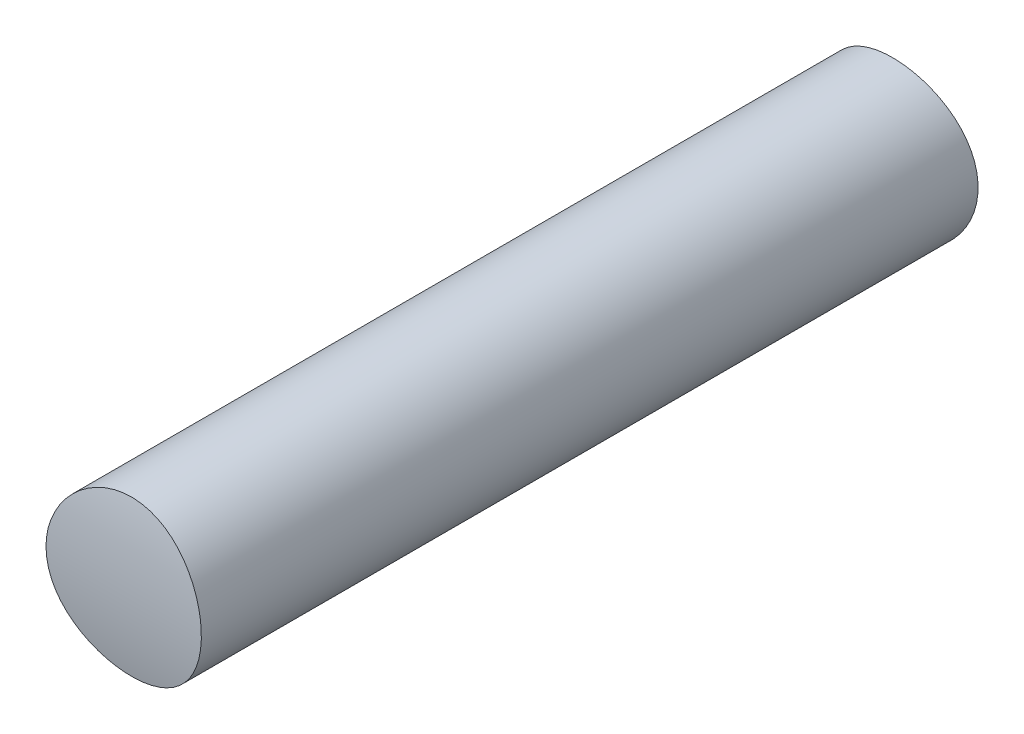
ISO-10303-21;
HEADER;
FILE_DESCRIPTION(('STEP AP214'),'2;1');
FILE_NAME('part.step','',(''),(''),'','','');
FILE_SCHEMA(('AUTOMOTIVE_DESIGN { 1 0 10303 214 1 1 1 1 }'));
ENDSEC;
DATA;
#1=APPLICATION_CONTEXT('core data for automotive mechanical design processes');
#2=APPLICATION_PROTOCOL_DEFINITION('international standard','automotive_design',2000,#1);
#3=PRODUCT_CONTEXT('',#1,'mechanical');
#4=PRODUCT('Part','Part','',(#3));
#5=PRODUCT_RELATED_PRODUCT_CATEGORY('part','',(#4));
#6=PRODUCT_DEFINITION_FORMATION('','',#4);
#7=PRODUCT_DEFINITION_CONTEXT('part definition',#1,'design');
#8=PRODUCT_DEFINITION('design','',#6,#7);
#9=PRODUCT_DEFINITION_SHAPE('','',#8);
#10=(LENGTH_UNIT() NAMED_UNIT(*) SI_UNIT(.MILLI.,.METRE.));
#11=(NAMED_UNIT(*) PLANE_ANGLE_UNIT() SI_UNIT($,.RADIAN.));
#12=(NAMED_UNIT(*) SI_UNIT($,.STERADIAN.) SOLID_ANGLE_UNIT());
#13=UNCERTAINTY_MEASURE_WITH_UNIT(LENGTH_MEASURE(1.E-05),#10,'distance_accuracy_value','');
#14=(GEOMETRIC_REPRESENTATION_CONTEXT(3) GLOBAL_UNCERTAINTY_ASSIGNED_CONTEXT((#13)) GLOBAL_UNIT_ASSIGNED_CONTEXT((#10,
#11,#12)) REPRESENTATION_CONTEXT('',''));
#15=CARTESIAN_POINT('',(0.,0.,0.));
#16=DIRECTION('',(0.,0.,1.));
#17=DIRECTION('',(1.,0.,0.));
#18=AXIS2_PLACEMENT_3D('',#15,#16,#17);
#19=CARTESIAN_POINT('',(0.,0.,37.5));
#20=DIRECTION('',(0.,0.,-1.));
#21=DIRECTION('',(-1.,0.,0.));
#22=AXIS2_PLACEMENT_3D('',#19,#20,#21);
#23=CYLINDRICAL_SURFACE('',#22,7.5);
#24=CARTESIAN_POINT('',(-7.5,0.,-37.5));
#25=CARTESIAN_POINT('',(-7.49999902971956,0.208285250918019,-37.4999995169678));
#26=CARTESIAN_POINT('',(-7.49131612405443,0.416595944699032,-37.4982602523473));
#27=CARTESIAN_POINT('',(-7.45664426063963,0.831795161758265,-37.4913491590143));
#28=CARTESIAN_POINT('',(-7.43064748066552,1.0386829995019,-37.4861757788082));
#29=CARTESIAN_POINT('',(-7.36149503695667,1.44979441328923,-37.4725293883136));
#30=CARTESIAN_POINT('',(-7.31831272239691,1.6540133400208,-37.4640512535298));
#31=CARTESIAN_POINT('',(-7.21511011170672,2.05807781361966,-37.4440282791705));
#32=CARTESIAN_POINT('',(-7.15508340534659,2.2579216642539,-37.4324822721878));
#33=CARTESIAN_POINT('',(-7.0187851239922,2.65140120687642,-37.4066689059164));
#34=CARTESIAN_POINT('',(-6.94254308411286,2.84504745934689,-37.3924064992328));
#35=CARTESIAN_POINT('',(-6.77428825915883,3.2252521960877,-37.3615329427972));
#36=CARTESIAN_POINT('',(-6.68226964591508,3.41180802979487,-37.3449209254522));
#37=CARTESIAN_POINT('',(-6.48322039652258,3.77636781419721,-37.3098185627179));
#38=CARTESIAN_POINT('',(-6.37620063391718,3.95437783493624,-37.2913295804949));
#39=CARTESIAN_POINT('',(-6.14780818386624,4.30087522835744,-37.2529579060111));
#40=CARTESIAN_POINT('',(-6.02643006447892,4.46935896127352,-37.2330746874594));
#41=CARTESIAN_POINT('',(-5.76866577078873,4.79755639657858,-37.192218618291));
#42=CARTESIAN_POINT('',(-5.6321189892616,4.9571427192329,-37.1712356574786));
#43=CARTESIAN_POINT('',(-5.34608468592072,5.26435639175619,-37.1289726594288));
#44=CARTESIAN_POINT('',(-5.19659129850026,5.41197826174014,-37.1076924912389));
#45=CARTESIAN_POINT('',(-4.8857061435719,5.69420372354363,-37.0654341911967));
#46=CARTESIAN_POINT('',(-4.72431279562634,5.828805580663,-37.0444560999071));
#47=CARTESIAN_POINT('',(-4.39080564665395,6.08398652665161,-37.0034026416353));
#48=CARTESIAN_POINT('',(-4.21869672948238,6.2045719330121,-36.9833268704816));
#49=CARTESIAN_POINT('',(-3.86316251866858,6.43202393251202,-36.9444517127192));
#50=CARTESIAN_POINT('',(-3.67964504016922,6.53874889172942,-36.9256663073429));
#51=CARTESIAN_POINT('',(-3.30413988201603,6.7362934120683,-36.8901399392458));
#52=CARTESIAN_POINT('',(-3.11215548629846,6.82711907306035,-36.8733981932111));
#53=CARTESIAN_POINT('',(-2.72094072838064,6.99225097605654,-36.8424414322892));
#54=CARTESIAN_POINT('',(-2.5217081902631,7.06655220895189,-36.8282271838324));
#55=CARTESIAN_POINT('',(-2.11756010982976,7.19799088390685,-36.8027636444553));
#56=CARTESIAN_POINT('',(-1.91264686283292,7.25513515101934,-36.7915131747607));
#57=CARTESIAN_POINT('',(-1.50119692955397,7.35122229614338,-36.7724339900126));
#58=CARTESIAN_POINT('',(-1.2947141202986,7.39038762689044,-36.7645635374252));
#59=CARTESIAN_POINT('',(-0.879165267599078,7.45125138010214,-36.7522763809965));
#60=CARTESIAN_POINT('',(-0.670100218718799,7.47295632686055,-36.7478583871179));
#61=CARTESIAN_POINT('',(-0.250821212441949,7.49874710722053,-36.74260423411));
#62=CARTESIAN_POINT('',(-0.0406071479912055,7.50283127007261,-36.7417684146316));
#63=CARTESIAN_POINT('',(0.379404347814056,7.4933421237438,-36.7437048678115));
#64=CARTESIAN_POINT('',(0.589201782647613,7.47976896263553,-36.746477110213));
#65=CARTESIAN_POINT('',(1.0036463337713,7.43541944129836,-36.7554762999837));
#66=CARTESIAN_POINT('',(1.20832315749137,7.4049092024866,-36.7616497946248));
#67=CARTESIAN_POINT('',(1.61440860579773,7.32710306324073,-36.7772366166266));
#68=CARTESIAN_POINT('',(1.81581607215807,7.27980134423553,-36.7866510670066));
#69=CARTESIAN_POINT('',(2.21382326765599,7.16879743887004,-36.8084438338772));
#70=CARTESIAN_POINT('',(2.41042451393873,7.1051005030216,-36.8208212014152));
#71=CARTESIAN_POINT('',(2.79761460561681,6.96175161590562,-36.8481931225643));
#72=CARTESIAN_POINT('',(2.98820118172495,6.88209372406487,-36.863188650371));
#73=CARTESIAN_POINT('',(3.36320817291061,6.70685770605166,-36.8954745648375));
#74=CARTESIAN_POINT('',(3.54758110214772,6.61118057945138,-36.912779077117));
#75=CARTESIAN_POINT('',(3.90769411401562,6.40491989100834,-36.9491267238105));
#76=CARTESIAN_POINT('',(4.08343118598493,6.29433118024173,-36.9681704580363));
#77=CARTESIAN_POINT('',(4.42502016164686,6.05905927201757,-37.0074589379098));
#78=CARTESIAN_POINT('',(4.5908735312183,5.9343781726258,-37.0277035045657));
#79=CARTESIAN_POINT('',(4.91163849412743,5.67175232845816,-37.0688398344937));
#80=CARTESIAN_POINT('',(5.0665499554376,5.53380742368564,-37.0897316055708));
#81=CARTESIAN_POINT('',(5.36709828642525,5.24297308993082,-37.131970129163));
#82=CARTESIAN_POINT('',(5.51251793361918,5.08985929419431,-37.1533183006386));
#83=CARTESIAN_POINT('',(5.78991839269497,4.77193228210156,-37.195488461239));
#84=CARTESIAN_POINT('',(5.92190373024777,4.60712303760459,-37.2163106257729));
#85=CARTESIAN_POINT('',(6.17167270163691,4.26673796614689,-37.2568697205683));
#86=CARTESIAN_POINT('',(6.28944475511812,4.09115353339292,-37.2766057588753));
#87=CARTESIAN_POINT('',(6.50977653322547,3.73060678119788,-37.3144129068572));
#88=CARTESIAN_POINT('',(6.61234204003817,3.54564806234884,-37.3324846483743));
#89=CARTESIAN_POINT('',(6.80181869301121,3.16704827835546,-37.3665093748376));
#90=CARTESIAN_POINT('',(6.88868601790013,2.97338473733911,-37.3824563970653));
#91=CARTESIAN_POINT('',(7.04572306438673,2.57929421395421,-37.4117128708408));
#92=CARTESIAN_POINT('',(7.11589930759353,2.37886990824627,-37.4250233522079));
#93=CARTESIAN_POINT('',(7.23894265517568,1.97297020126236,-37.4486134500925));
#94=CARTESIAN_POINT('',(7.29183836230164,1.76750375817339,-37.4588980721788));
#95=CARTESIAN_POINT('',(7.38003422880102,1.35277742961405,-37.476166119013));
#96=CARTESIAN_POINT('',(7.41534275783687,1.14351939777807,-37.4831511139574));
#97=CARTESIAN_POINT('',(7.46112304973197,0.778434766567267,-37.4922393572955));
#98=CARTESIAN_POINT('',(7.47569545520945,0.623129384709211,-37.4951454468941));
#99=CARTESIAN_POINT('',(7.49513430028926,0.311887423629806,-37.4990259504125));
#100=CARTESIAN_POINT('',(7.50000072648473,0.155950843536883,-37.500000361664));
#101=CARTESIAN_POINT('',(7.49999902971958,-0.208285250918016,-37.4999995169678));
#102=CARTESIAN_POINT('',(7.49131612405443,-0.416595944699027,-37.4982602523473));
#103=CARTESIAN_POINT('',(7.45664426063963,-0.83179516175826,-37.4913491590143));
#104=CARTESIAN_POINT('',(7.43064748066552,-1.03868299950189,-37.4861757788082));
#105=CARTESIAN_POINT('',(7.36149503695667,-1.44979441328922,-37.4725293883136));
#106=CARTESIAN_POINT('',(7.31831272239692,-1.6540133400208,-37.4640512535298));
#107=CARTESIAN_POINT('',(7.21511011170672,-2.05807781361966,-37.4440282791705));
#108=CARTESIAN_POINT('',(7.15508340534659,-2.2579216642539,-37.4324822721878));
#109=CARTESIAN_POINT('',(7.0187851239922,-2.65140120687642,-37.4066689059164));
#110=CARTESIAN_POINT('',(6.94254308411286,-2.84504745934689,-37.3924064992328));
#111=CARTESIAN_POINT('',(6.77428825915883,-3.2252521960877,-37.3615329427972));
#112=CARTESIAN_POINT('',(6.68226964591508,-3.41180802979488,-37.3449209254522));
#113=CARTESIAN_POINT('',(6.48322039652258,-3.77636781419721,-37.3098185627179));
#114=CARTESIAN_POINT('',(6.37620063391718,-3.95437783493624,-37.2913295804949));
#115=CARTESIAN_POINT('',(6.14780818386623,-4.30087522835744,-37.2529579060111));
#116=CARTESIAN_POINT('',(6.02643006447892,-4.46935896127353,-37.2330746874594));
#117=CARTESIAN_POINT('',(5.76866577078873,-4.79755639657858,-37.192218618291));
#118=CARTESIAN_POINT('',(5.6321189892616,-4.9571427192329,-37.1712356574786));
#119=CARTESIAN_POINT('',(5.34608468592072,-5.26435639175619,-37.1289726594288));
#120=CARTESIAN_POINT('',(5.19659129850026,-5.41197826174014,-37.1076924912389));
#121=CARTESIAN_POINT('',(4.8857061435719,-5.69420372354363,-37.0654341911967));
#122=CARTESIAN_POINT('',(4.72431279562634,-5.82880558066301,-37.0444560999071));
#123=CARTESIAN_POINT('',(4.39080564665395,-6.08398652665161,-37.0034026416353));
#124=CARTESIAN_POINT('',(4.21869672948238,-6.2045719330121,-36.9833268704816));
#125=CARTESIAN_POINT('',(3.86316251866858,-6.43202393251202,-36.9444517127192));
#126=CARTESIAN_POINT('',(3.67964504016922,-6.53874889172942,-36.9256663073429));
#127=CARTESIAN_POINT('',(3.30413988201603,-6.7362934120683,-36.8901399392458));
#128=CARTESIAN_POINT('',(3.11215548629846,-6.82711907306035,-36.8733981932111));
#129=CARTESIAN_POINT('',(2.72094072838064,-6.99225097605654,-36.8424414322892));
#130=CARTESIAN_POINT('',(2.5217081902631,-7.06655220895189,-36.8282271838324));
#131=CARTESIAN_POINT('',(2.11756010982976,-7.19799088390685,-36.8027636444553));
#132=CARTESIAN_POINT('',(1.91264686283292,-7.25513515101934,-36.7915131747607));
#133=CARTESIAN_POINT('',(1.50119692955397,-7.35122229614337,-36.7724339900126));
#134=CARTESIAN_POINT('',(1.2947141202986,-7.39038762689044,-36.7645635374252));
#135=CARTESIAN_POINT('',(0.87916526759908,-7.45125138010214,-36.7522763809965));
#136=CARTESIAN_POINT('',(0.6701002187188,-7.47295632686055,-36.7478583871179));
#137=CARTESIAN_POINT('',(0.250821212441949,-7.49874710722053,-36.74260423411));
#138=CARTESIAN_POINT('',(0.0406071479912055,-7.50283127007261,-36.7417684146316));
#139=CARTESIAN_POINT('',(-0.379404347814056,-7.4933421237438,-36.7437048678115));
#140=CARTESIAN_POINT('',(-0.589201782647614,-7.47976896263553,-36.746477110213));
#141=CARTESIAN_POINT('',(-1.0036463337713,-7.43541944129836,-36.7554762999837));
#142=CARTESIAN_POINT('',(-1.20832315749137,-7.4049092024866,-36.7616497946248));
#143=CARTESIAN_POINT('',(-1.61440860579773,-7.32710306324073,-36.7772366166266));
#144=CARTESIAN_POINT('',(-1.81581607215807,-7.27980134423553,-36.7866510670066));
#145=CARTESIAN_POINT('',(-2.21382326765599,-7.16879743887004,-36.8084438338772));
#146=CARTESIAN_POINT('',(-2.41042451393873,-7.1051005030216,-36.8208212014152));
#147=CARTESIAN_POINT('',(-2.79761460561681,-6.96175161590562,-36.8481931225643));
#148=CARTESIAN_POINT('',(-2.98820118172495,-6.88209372406487,-36.863188650371));
#149=CARTESIAN_POINT('',(-3.36320817291061,-6.70685770605166,-36.8954745648375));
#150=CARTESIAN_POINT('',(-3.54758110214772,-6.61118057945138,-36.912779077117));
#151=CARTESIAN_POINT('',(-3.90769411401562,-6.40491989100834,-36.9491267238105));
#152=CARTESIAN_POINT('',(-4.08343118598492,-6.29433118024173,-36.9681704580363));
#153=CARTESIAN_POINT('',(-4.42502016164686,-6.05905927201757,-37.0074589379098));
#154=CARTESIAN_POINT('',(-4.5908735312183,-5.9343781726258,-37.0277035045657));
#155=CARTESIAN_POINT('',(-4.91163849412743,-5.67175232845816,-37.0688398344937));
#156=CARTESIAN_POINT('',(-5.0665499554376,-5.53380742368564,-37.0897316055708));
#157=CARTESIAN_POINT('',(-5.36709828642525,-5.24297308993082,-37.131970129163));
#158=CARTESIAN_POINT('',(-5.51251793361918,-5.08985929419431,-37.1533183006386));
#159=CARTESIAN_POINT('',(-5.78991839269497,-4.77193228210156,-37.195488461239));
#160=CARTESIAN_POINT('',(-5.92190373024777,-4.60712303760459,-37.2163106257729));
#161=CARTESIAN_POINT('',(-6.17167270163691,-4.26673796614689,-37.2568697205683));
#162=CARTESIAN_POINT('',(-6.28944475511812,-4.09115353339291,-37.2766057588753));
#163=CARTESIAN_POINT('',(-6.50977653322548,-3.73060678119788,-37.3144129068572));
#164=CARTESIAN_POINT('',(-6.61234204003817,-3.54564806234884,-37.3324846483743));
#165=CARTESIAN_POINT('',(-6.80181869301121,-3.16704827835546,-37.3665093748376));
#166=CARTESIAN_POINT('',(-6.88868601790013,-2.97338473733911,-37.3824563970653));
#167=CARTESIAN_POINT('',(-7.04572306438673,-2.57929421395421,-37.4117128708408));
#168=CARTESIAN_POINT('',(-7.11589930759353,-2.37886990824627,-37.4250233522079));
#169=CARTESIAN_POINT('',(-7.23894265517568,-1.97297020126237,-37.4486134500925));
#170=CARTESIAN_POINT('',(-7.29183836230164,-1.76750375817339,-37.4588980721788));
#171=CARTESIAN_POINT('',(-7.38003422880102,-1.35277742961405,-37.476166119013));
#172=CARTESIAN_POINT('',(-7.41534275783686,-1.14351939777807,-37.4831511139574));
#173=CARTESIAN_POINT('',(-7.46112304973197,-0.778434766567266,-37.4922393572955));
#174=CARTESIAN_POINT('',(-7.47569545520946,-0.623129384709209,-37.4951454468941));
#175=CARTESIAN_POINT('',(-7.49513430028926,-0.311887423629804,-37.4990259504125));
#176=CARTESIAN_POINT('',(-7.50000072648472,-0.155950843536881,-37.500000361664));
#177=CARTESIAN_POINT('',(-7.5,0.,-37.5));
#178=B_SPLINE_CURVE_WITH_KNOTS('',3,(#24,#25,#26,#27,#28,#29,#30,#31,#32,#33,#34,#35,#36,#37,
#38,#39,#40,#41,#42,#43,#44,#45,#46,#47,#48,#49,#50,#51,#52,#53,#54,#55,#56,#57,#58,#59,#60,#61,
#62,#63,#64,#65,#66,#67,#68,#69,#70,#71,#72,#73,#74,#75,#76,#77,#78,#79,#80,#81,#82,#83,#84,#85,
#86,#87,#88,#89,#90,#91,#92,#93,#94,#95,#96,#97,#98,#99,#100,#101,#102,#103,#104,#105,#106,#107,
#108,#109,#110,#111,#112,#113,#114,#115,#116,#117,#118,#119,#120,#121,#122,#123,#124,#125,#126,
#127,#128,#129,#130,#131,#132,#133,#134,#135,#136,#137,#138,#139,#140,#141,#142,#143,#144,#145,
#146,#147,#148,#149,#150,#151,#152,#153,#154,#155,#156,#157,#158,#159,#160,#161,#162,#163,#164,
#165,#166,#167,#168,#169,#170,#171,#172,#173,#174,#175,#176,#177),.UNSPECIFIED.,.T.,.F.,(4,2,2,
2,2,2,2,2,2,2,2,2,2,2,2,2,2,2,2,2,2,2,2,2,2,2,2,2,2,2,2,2,2,2,2,2,2,2,2,2,2,2,2,2,2,2,2,2,2,2,2,
2,2,2,2,2,2,2,2,2,2,2,2,2,2,2,2,2,2,2,2,2,2,2,2,2,4),(0.,0.624712197528687,1.24970682502355,
1.8756744764054,2.50188066717014,3.12695588782765,3.75226252278795,4.37711822744394,
5.00221108322053,5.63470129433434,6.26747957662201,6.90034205030294,7.53291816513303,
8.17152043794301,8.80987716724068,9.44842714092995,10.0867227614111,10.7168925185891,
11.3468266953313,11.9768205992162,12.606809220067,13.227168486148,13.8477429288317,
14.4681188814138,15.0887261645959,15.7133209016402,16.3381318642615,16.9628499276509,
17.587575527741,18.2235499120322,18.8593093389876,19.4955833067907,20.1316147117834,
20.7693950512931,21.4069257837235,22.0433958646003,22.6795627620186,23.1473071614475,
23.6150522069703,24.239764404499,24.8647590319938,25.4907266833757,26.1169328741404,
26.7420080947979,27.3673147297582,27.9921704344142,28.6172632901908,29.2497535013046,
29.8825317835923,30.5153942572732,31.1479703721033,31.7865726449133,32.424929374211,
33.0634793479002,33.7017749683814,34.3319447255593,34.9618789023016,35.5918728061865,
36.2218614270373,36.8422206931183,37.462795135802,38.0831710883841,38.7037783715662,
39.3283731086104,39.9531840712318,40.5779021346212,41.2026277347112,41.8386021190025,
42.4743615459578,43.1106355137609,43.7466669187537,44.3844472582634,45.0219779906937,
45.6584480715706,46.2946149689889,46.7623593684178,47.2301044139406),.UNSPECIFIED.);
#179=CARTESIAN_POINT('',(-7.5,0.,-37.5));
#180=VERTEX_POINT('',#179);
#181=EDGE_CURVE('E43',#180,#180,#178,.T.);
#182=ORIENTED_EDGE('',*,*,#181,.F.);
#183=EDGE_LOOP('',(#182));
#184=FACE_BOUND('',#183,.T.);
#185=CARTESIAN_POINT('',(-7.5,0.,37.5));
#186=CARTESIAN_POINT('',(-7.50000415406846,-0.208483315310918,37.5000021097477));
#187=CARTESIAN_POINT('',(-7.49130470044979,-0.41691460283817,37.4982583792321));
#188=CARTESIAN_POINT('',(-7.4565840093247,-0.832334416575861,37.4913367448348));
#189=CARTESIAN_POINT('',(-7.43055984843312,-1.03932269333409,37.4861582613707));
#190=CARTESIAN_POINT('',(-7.36137215586304,-1.45040572618121,37.4725053637865));
#191=CARTESIAN_POINT('',(-7.31819976645866,-1.65449893033555,37.4640292463569));
#192=CARTESIAN_POINT('',(-7.21503802103792,-2.05831663415844,37.4440143844082));
#193=CARTESIAN_POINT('',(-7.15504248405728,-2.25803949899806,37.4324745143239));
#194=CARTESIAN_POINT('',(-7.01879438710297,-2.65137476573173,37.4066706680657));
#195=CARTESIAN_POINT('',(-6.94256376440252,-2.84499501234896,37.3924103704889));
#196=CARTESIAN_POINT('',(-6.77433604938429,-3.22514992041127,37.3615416354369));
#197=CARTESIAN_POINT('',(-6.68233313914487,-3.41168193609257,37.3449323318815));
#198=CARTESIAN_POINT('',(-6.48329211776848,-3.77624624960627,37.3098310017852));
#199=CARTESIAN_POINT('',(-6.37626078318279,-3.95428233017419,37.2913398248392));
#200=CARTESIAN_POINT('',(-6.1478411800004,-4.30082942089902,37.2529633108609));
#201=CARTESIAN_POINT('',(-6.0264474766386,-4.46933678948473,37.2330774472415));
#202=CARTESIAN_POINT('',(-5.7686623125843,-4.7975608015667,37.1922180702349));
#203=CARTESIAN_POINT('',(-5.63211170999935,-4.95715122717416,37.1712345389031));
#204=CARTESIAN_POINT('',(-5.34606910527543,-5.26437243600153,37.1289704003494));
#205=CARTESIAN_POINT('',(-5.1965712379913,-5.41199773974933,37.107689662192));
#206=CARTESIAN_POINT('',(-4.88568482306476,-5.69422181145278,37.0654313950635));
#207=CARTESIAN_POINT('',(-4.72429532675039,-5.82881953812857,37.0444538904434));
#208=CARTESIAN_POINT('',(-4.39079648375255,-6.08399294654521,37.003401572794));
#209=CARTESIAN_POINT('',(-4.21869202069831,-6.20457494551161,36.9833263556041));
#210=CARTESIAN_POINT('',(-3.86316327859793,-6.43202344628043,36.9444517958174));
#211=CARTESIAN_POINT('',(-3.67964660010331,-6.53874798452959,36.9256664669901));
#212=CARTESIAN_POINT('',(-3.30414310550971,-6.73629180278303,36.8901402321636));
#213=CARTESIAN_POINT('',(-3.11215957311373,-6.82711718222068,36.8733985429072));
#214=CARTESIAN_POINT('',(-2.72094493411017,-6.99224936665368,36.8424417389775));
#215=CARTESIAN_POINT('',(-2.52171159076531,-7.06655102254029,36.8282274121546));
#216=CARTESIAN_POINT('',(-2.11756184589631,-7.19799039974723,36.8027637397732));
#217=CARTESIAN_POINT('',(-1.91264773972819,-7.25513494622282,36.7915132154231));
#218=CARTESIAN_POINT('',(-1.50119677217586,-7.35122233290873,36.7724339827146));
#219=CARTESIAN_POINT('',(-1.29471380265331,-7.39038768714153,36.7645635253232));
#220=CARTESIAN_POINT('',(-0.879164627113547,-7.45125146019002,36.7522763647667));
#221=CARTESIAN_POINT('',(-0.670099415671663,-7.47295640337694,36.747858371549));
#222=CARTESIAN_POINT('',(-0.250820406690045,-7.49874712966212,36.7426042295188));
#223=CARTESIAN_POINT('',(-0.040606503827776,-7.50283126903194,36.7417684148642));
#224=CARTESIAN_POINT('',(0.379404668906108,-7.49334210297715,36.7437048720291));
#225=CARTESIAN_POINT('',(0.589201942255277,-7.47976894556144,36.7464771136048));
#226=CARTESIAN_POINT('',(1.00364711210596,-7.43541935800376,36.7554763169571));
#227=CARTESIAN_POINT('',(1.20832470734035,-7.40490897147401,36.7616498416296));
#228=CARTESIAN_POINT('',(1.61441167976592,-7.32710240830468,36.7772367471033));
#229=CARTESIAN_POINT('',(1.81581989853831,-7.27980041213413,36.7866512511086));
#230=CARTESIAN_POINT('',(2.2138269122664,-7.16879628734338,36.808444057063));
#231=CARTESIAN_POINT('',(2.41042726338708,-7.10509954425792,36.8208213856562));
#232=CARTESIAN_POINT('',(2.79761584046053,-6.96175109954607,36.8481932199925));
#233=CARTESIAN_POINT('',(2.98820179013212,-6.88209343903769,36.8631887029329));
#234=CARTESIAN_POINT('',(3.36319921077539,-6.70686189467481,36.8954737930672));
#235=CARTESIAN_POINT('',(3.54756352736487,-6.61118970163632,36.9127774272521));
#236=CARTESIAN_POINT('',(3.90766409763828,-6.40493802768173,36.9491235700507));
#237=CARTESIAN_POINT('',(4.0833971533219,-6.29435307738543,36.9681667158144));
#238=CARTESIAN_POINT('',(4.42495856685814,-6.05910323823583,37.007451680742));
#239=CARTESIAN_POINT('',(4.59078954975946,-5.93444210655371,37.0276931793623));
#240=CARTESIAN_POINT('',(4.91157109943957,-5.67181233229327,37.0688307465389));
#241=CARTESIAN_POINT('',(5.06651758308154,-5.53383874135229,37.0897270565307));
#242=CARTESIAN_POINT('',(5.36707826434377,-5.24299247341352,37.1319673147738));
#243=CARTESIAN_POINT('',(5.51247947298022,-5.08989980615945,37.1533126540753));
#244=CARTESIAN_POINT('',(5.78994262793909,-4.77190807366215,37.1954919452116));
#245=CARTESIAN_POINT('',(5.92199985587514,-4.60700486722731,37.2163257141993));
#246=CARTESIAN_POINT('',(6.17177665724625,-4.26658345159894,37.2568871237155));
#247=CARTESIAN_POINT('',(6.28949833892692,-4.09106680895753,37.2766149266612));
#248=CARTESIAN_POINT('',(6.50978227866336,-3.73059642031793,37.3144139195139));
#249=CARTESIAN_POINT('',(6.61234470988114,-3.54564278214968,37.332485128343));
#250=CARTESIAN_POINT('',(6.80172211840374,-3.16724119278212,37.3664920321893));
#251=CARTESIAN_POINT('',(6.88850910684399,-2.97377888610105,37.3824239187797));
#252=CARTESIAN_POINT('',(7.04542346872728,-2.58009570605891,37.4116565757603));
#253=CARTESIAN_POINT('',(7.11555662288271,-2.37987720548218,37.4249582588515));
#254=CARTESIAN_POINT('',(7.23865573273428,-1.9740391522938,37.4485578358328));
#255=CARTESIAN_POINT('',(7.29162038260822,-1.76841919013666,37.458855501234));
#256=CARTESIAN_POINT('',(7.37994707683015,-1.35329640920947,37.4761489474015));
#257=CARTESIAN_POINT('',(7.41530937121296,-1.143793645637,37.4831447750692));
#258=CARTESIAN_POINT('',(7.46769432554848,-0.726022872298725,37.4935435942351));
#259=CARTESIAN_POINT('',(7.48501703979332,-0.517793904389697,37.4970053485391));
#260=CARTESIAN_POINT('',(7.50223405346,-0.100514006223324,37.5004459103632));
#261=CARTESIAN_POINT('',(7.50212229346546,0.108537184557892,37.5004235069515));
#262=CARTESIAN_POINT('',(7.48445807855669,0.525819777437648,37.4968937200496));
#263=CARTESIAN_POINT('',(7.46690988949873,0.734051367543202,37.493387188958));
#264=CARTESIAN_POINT('',(7.41451997179765,1.14824650562539,37.4829887885253));
#265=CARTESIAN_POINT('',(7.37967783857597,1.35421000042644,37.4760968399849));
#266=CARTESIAN_POINT('',(7.29336932485347,1.76054367551311,37.4591973333901));
#267=CARTESIAN_POINT('',(7.24205586241375,1.96094756464056,37.4492184637627));
#268=CARTESIAN_POINT('',(7.12311271317182,2.35668278023705,37.4263988505881));
#269=CARTESIAN_POINT('',(7.05548315559324,2.55201414686695,37.4135581297068));
#270=CARTESIAN_POINT('',(6.90440792878432,2.93628621963515,37.3853627122177));
#271=CARTESIAN_POINT('',(6.82096124398325,3.12522651450326,37.3700078541931));
#272=CARTESIAN_POINT('',(6.63886096332044,3.49543705856643,37.3371993875037));
#273=CARTESIAN_POINT('',(6.54020741795749,3.67670733322947,37.3197457858083));
#274=CARTESIAN_POINT('',(6.32706970789877,4.03258484683883,37.2829808336499));
#275=CARTESIAN_POINT('',(6.21240405193511,4.20708129122912,37.2636490923871));
#276=CARTESIAN_POINT('',(5.96904288951177,4.54576684050287,37.2238508628629));
#277=CARTESIAN_POINT('',(5.8403522674888,4.70995950266232,37.2033847708714));
#278=CARTESIAN_POINT('',(5.56972552811313,5.02708957326882,37.1618616507606));
#279=CARTESIAN_POINT('',(5.42778342171903,5.1800218361536,37.1408043584827));
#280=CARTESIAN_POINT('',(5.13170963552587,5.47348023494801,37.0986924987934));
#281=CARTESIAN_POINT('',(4.97758232661547,5.61401078147505,37.0776379330941));
#282=CARTESIAN_POINT('',(4.65561631740762,5.88388008800991,37.0357786000378));
#283=CARTESIAN_POINT('',(4.48760097057214,6.0130096061901,37.0149828796051));
#284=CARTESIAN_POINT('',(4.14121601563338,6.2566080498131,36.9745872135942));
#285=CARTESIAN_POINT('',(3.96285024288188,6.37108235596721,36.9549868305356));
#286=CARTESIAN_POINT('',(3.59686678965576,6.58463755429622,36.9175339181867));
#287=CARTESIAN_POINT('',(3.40924584326965,6.68371296066232,36.8996820126197));
#288=CARTESIAN_POINT('',(3.02619151962431,6.86564665357399,36.8662644264114));
#289=CARTESIAN_POINT('',(2.83076123028599,6.94851127514729,36.8506978532788));
#290=CARTESIAN_POINT('',(2.43437144559592,7.09707091203924,36.822374711348));
#291=CARTESIAN_POINT('',(2.23344350624725,7.16284756433133,36.8096048292481));
#292=CARTESIAN_POINT('',(1.82666509150451,7.27721885454303,36.7871646774489));
#293=CARTESIAN_POINT('',(1.62081648291062,7.32581990145493,36.777493251702));
#294=CARTESIAN_POINT('',(1.20560630510901,7.40548466479412,36.7615349291007));
#295=CARTESIAN_POINT('',(0.996244469122745,7.43654704315243,36.7552482904819));
#296=CARTESIAN_POINT('',(0.575569560083804,7.48087232675321,36.7462523700107));
#297=CARTESIAN_POINT('',(0.364256514751329,7.49413548447293,36.7435430374152));
#298=CARTESIAN_POINT('',(-0.0548676279124329,7.50267395939909,36.7418004440825));
#299=CARTESIAN_POINT('',(-0.262671892806006,7.49827463763881,36.7427006907782));
#300=CARTESIAN_POINT('',(-0.677227020143757,7.47224940255876,36.7480021903901));
#301=CARTESIAN_POINT('',(-0.883977491485999,7.45061750423539,36.7524046596538));
#302=CARTESIAN_POINT('',(-1.2947943254336,7.39030407682712,36.764580089633));
#303=CARTESIAN_POINT('',(-1.4988616708182,7.35162898025212,36.7723517787065));
#304=CARTESIAN_POINT('',(-1.90302537971458,7.25751762390039,36.7910415327967));
#305=CARTESIAN_POINT('',(-2.10312024176781,7.20207515050235,36.8019607641531));
#306=CARTESIAN_POINT('',(-2.49734556104152,7.07502941214461,36.8265954172696));
#307=CARTESIAN_POINT('',(-2.69149039723702,7.00346929039375,36.8403033649738));
#308=CARTESIAN_POINT('',(-3.07305484128186,6.84463592993069,36.8701435324314));
#309=CARTESIAN_POINT('',(-3.26047421559238,6.75736214620025,36.8862758362687));
#310=CARTESIAN_POINT('',(-3.62733863002169,6.56772825515018,36.920512239071));
#311=CARTESIAN_POINT('',(-3.80678332182147,6.46536748970107,36.938616424045));
#312=CARTESIAN_POINT('',(-4.15651311230678,6.24627716794432,36.9762947245103));
#313=CARTESIAN_POINT('',(-4.3267980819474,6.12954740927814,36.9958688607013));
#314=CARTESIAN_POINT('',(-4.65991154810879,5.88040938896427,37.036292677648));
#315=CARTESIAN_POINT('',(-4.82256395862688,5.74776822725967,37.0571583909656));
#316=CARTESIAN_POINT('',(-5.13615606408507,5.46935687274789,37.0992715695963));
#317=CARTESIAN_POINT('',(-5.28709589118108,5.32358682811718,37.1205190305987));
#318=CARTESIAN_POINT('',(-5.57631086106478,5.01983590048018,37.1628142700838));
#319=CARTESIAN_POINT('',(-5.7145806404544,4.86184989799891,37.1838619606524));
#320=CARTESIAN_POINT('',(-5.97739026120306,4.53484188370158,37.2251575434954));
#321=CARTESIAN_POINT('',(-6.10193512055828,4.36582394152433,37.2454057263305));
#322=CARTESIAN_POINT('',(-6.33776091387043,4.01594005631662,37.2847629016773));
#323=CARTESIAN_POINT('',(-6.44888297278341,3.83496530621429,37.3038571206718));
#324=CARTESIAN_POINT('',(-6.65541661072577,3.46416700040671,37.3401156271458));
#325=CARTESIAN_POINT('',(-6.75083397632297,3.27434673715674,37.3572806247256));
#326=CARTESIAN_POINT('',(-6.92523675529546,2.88723498954161,37.389190267871));
#327=CARTESIAN_POINT('',(-7.00423210546083,2.68994810908542,37.4039363759352));
#328=CARTESIAN_POINT('',(-7.14523152105939,2.28927663717611,37.4305965678313));
#329=CARTESIAN_POINT('',(-7.20723885993585,2.08589322886263,37.442511197206));
#330=CARTESIAN_POINT('',(-7.33983469078939,1.57380323523498,37.46821309223));
#331=CARTESIAN_POINT('',(-7.39981471601755,1.26218624106522,37.4800712854718));
#332=CARTESIAN_POINT('',(-7.47989357918396,0.633672680464612,37.4959630118578));
#333=CARTESIAN_POINT('',(-7.49999368817422,0.316776282623468,37.4999967943813));
#334=CARTESIAN_POINT('',(-7.5,0.,37.5));
#335=B_SPLINE_CURVE_WITH_KNOTS('',3,(#185,#186,#187,#188,#189,#190,#191,#192,#193,#194,#195,
#196,#197,#198,#199,#200,#201,#202,#203,#204,#205,#206,#207,#208,#209,#210,#211,#212,#213,#214,
#215,#216,#217,#218,#219,#220,#221,#222,#223,#224,#225,#226,#227,#228,#229,#230,#231,#232,#233,
#234,#235,#236,#237,#238,#239,#240,#241,#242,#243,#244,#245,#246,#247,#248,#249,#250,#251,#252,
#253,#254,#255,#256,#257,#258,#259,#260,#261,#262,#263,#264,#265,#266,#267,#268,#269,#270,#271,
#272,#273,#274,#275,#276,#277,#278,#279,#280,#281,#282,#283,#284,#285,#286,#287,#288,#289,#290,
#291,#292,#293,#294,#295,#296,#297,#298,#299,#300,#301,#302,#303,#304,#305,#306,#307,#308,#309,
#310,#311,#312,#313,#314,#315,#316,#317,#318,#319,#320,#321,#322,#323,#324,#325,#326,#327,#328,
#329,#330,#331,#332,#333,#334),.UNSPECIFIED.,.T.,.F.,(4,2,2,2,2,2,2,2,2,2,2,2,2,2,2,2,2,2,2,2,2,
2,2,2,2,2,2,2,2,2,2,2,2,2,2,2,2,2,2,2,2,2,2,2,2,2,2,2,2,2,2,2,2,2,2,2,2,2,2,2,2,2,2,2,2,2,2,2,2,
2,2,2,2,2,4),(0.,0.625171788236199,1.25044909521505,1.87604980309508,2.50188066372338,
3.12687119053535,3.75209275553386,4.3770332983578,5.00221108155898,5.63471814112609,
6.2675132419863,6.90035887976465,7.53291816354519,8.17151772410143,8.80987175766558,
9.44842443669745,10.0867227597562,10.7168930013115,11.3468276598176,11.9768210794987,
12.6068092184148,13.2271708322685,13.84774765741,14.4681208879416,15.0887261629095,
15.7132911534557,16.3380858346729,16.9627141400789,17.58757552662,18.2234659200914,
18.8595803811642,19.4956011793063,20.1316147117104,20.7687458767553,21.4056555628661,
22.0426136804386,22.6795627500027,23.3057394185827,23.9321337176781,24.5583748059139,
25.1846305452698,25.8052326454105,26.4258298305379,27.0464668758717,27.6671018602448,
28.2954494412825,28.9235788845368,29.5519935995908,30.1801839132975,30.8181921574725,
31.4559654788076,32.093965486638,32.7317156696007,33.3663605438108,34.000768352752,
34.635224555717,35.2696717589928,35.8924859130345,36.5155164694753,37.1383120804368,
37.7613387691546,38.3827171721884,39.0041171314846,39.6255442057296,40.2469800325345,
40.8789855974446,41.5109840302459,42.1432487721929,42.7752815781831,43.414183802787,
44.05285008723,44.6911287892514,45.3292844138289,46.2792208967571,47.2291271028397),.UNSPECIFIED.);
#336=CARTESIAN_POINT('',(-7.5,0.,37.5));
#337=VERTEX_POINT('',#336);
#338=EDGE_CURVE('E11',#337,#337,#335,.T.);
#339=ORIENTED_EDGE('',*,*,#338,.F.);
#340=EDGE_LOOP('',(#339));
#341=FACE_BOUND('',#340,.T.);
#342=ADVANCED_FACE('F33',(#184,#341),#23,.T.);
#343=CARTESIAN_POINT('',(-7.5,0.,0.));
#344=DIRECTION('',(1.,0.,0.));
#345=DIRECTION('',(0.,0.,-1.));
#346=AXIS2_PLACEMENT_3D('',#343,#344,#345);
#347=CYLINDRICAL_SURFACE('',#346,37.5);
#348=ORIENTED_EDGE('',*,*,#181,.T.);
#349=EDGE_LOOP('',(#348));
#350=FACE_BOUND('',#349,.T.);
#351=ADVANCED_FACE('F55',(#350),#347,.T.);
#352=ORIENTED_EDGE('',*,*,#338,.T.);
#353=EDGE_LOOP('',(#352));
#354=FACE_BOUND('',#353,.T.);
#355=ADVANCED_FACE('F52',(#354),#347,.T.);
#356=CLOSED_SHELL('',(#342,#351,#355));
#357=MANIFOLD_SOLID_BREP('B2',#356);
#358=ADVANCED_BREP_SHAPE_REPRESENTATION('',(#18,#357),#14);
#359=SHAPE_DEFINITION_REPRESENTATION(#9,#358);
ENDSEC;
END-ISO-10303-21;
